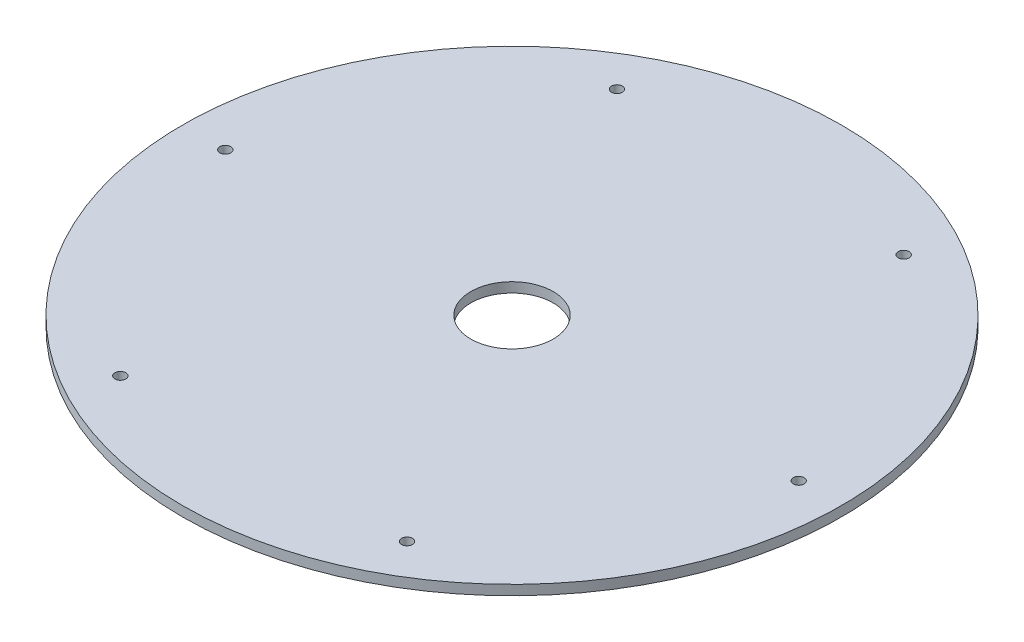
ISO-10303-21;
HEADER;
FILE_DESCRIPTION(('STEP AP214'),'2;1');
FILE_NAME('part.step','',(''),(''),'','','');
FILE_SCHEMA(('AUTOMOTIVE_DESIGN { 1 0 10303 214 1 1 1 1 }'));
ENDSEC;
DATA;
#1=APPLICATION_CONTEXT('core data for automotive mechanical design processes');
#2=APPLICATION_PROTOCOL_DEFINITION('international standard','automotive_design',2000,#1);
#3=PRODUCT_CONTEXT('',#1,'mechanical');
#4=PRODUCT('Part','Part','',(#3));
#5=PRODUCT_RELATED_PRODUCT_CATEGORY('part','',(#4));
#6=PRODUCT_DEFINITION_FORMATION('','',#4);
#7=PRODUCT_DEFINITION_CONTEXT('part definition',#1,'design');
#8=PRODUCT_DEFINITION('design','',#6,#7);
#9=PRODUCT_DEFINITION_SHAPE('','',#8);
#10=(LENGTH_UNIT() NAMED_UNIT(*) SI_UNIT(.MILLI.,.METRE.));
#11=(NAMED_UNIT(*) PLANE_ANGLE_UNIT() SI_UNIT($,.RADIAN.));
#12=(NAMED_UNIT(*) SI_UNIT($,.STERADIAN.) SOLID_ANGLE_UNIT());
#13=UNCERTAINTY_MEASURE_WITH_UNIT(LENGTH_MEASURE(1.E-05),#10,'distance_accuracy_value','');
#14=(GEOMETRIC_REPRESENTATION_CONTEXT(3) GLOBAL_UNCERTAINTY_ASSIGNED_CONTEXT((#13)) GLOBAL_UNIT_ASSIGNED_CONTEXT((#10,
#11,#12)) REPRESENTATION_CONTEXT('',''));
#15=CARTESIAN_POINT('',(0.,0.,0.));
#16=DIRECTION('',(0.,0.,1.));
#17=DIRECTION('',(1.,0.,0.));
#18=AXIS2_PLACEMENT_3D('',#15,#16,#17);
#19=CARTESIAN_POINT('',(0.,3.,0.));
#20=DIRECTION('',(0.,1.,0.));
#21=DIRECTION('',(0.,0.,1.));
#22=AXIS2_PLACEMENT_3D('',#19,#20,#21);
#23=PLANE('',#22);
#24=CARTESIAN_POINT('',(0.,3.,0.));
#25=DIRECTION('',(0.,1.,0.));
#26=DIRECTION('',(0.,0.,1.));
#27=AXIS2_PLACEMENT_3D('',#24,#25,#26);
#28=CIRCLE('',#27,12.5);
#29=CARTESIAN_POINT('',(0.,3.,12.5));
#30=VERTEX_POINT('',#29);
#31=EDGE_CURVE('E79',#30,#30,#28,.T.);
#32=ORIENTED_EDGE('',*,*,#31,.F.);
#33=EDGE_LOOP('',(#32));
#34=FACE_BOUND('',#33,.T.);
#35=CARTESIAN_POINT('',(43.5,3.,75.3442101292461));
#36=DIRECTION('',(0.,1.,0.));
#37=DIRECTION('',(0.,0.,1.));
#38=AXIS2_PLACEMENT_3D('',#35,#36,#37);
#39=CIRCLE('',#38,1.65);
#40=CARTESIAN_POINT('',(43.5,3.,76.9942101292461));
#41=VERTEX_POINT('',#40);
#42=EDGE_CURVE('E64',#41,#41,#39,.T.);
#43=ORIENTED_EDGE('',*,*,#42,.F.);
#44=EDGE_LOOP('',(#43));
#45=FACE_BOUND('',#44,.T.);
#46=CARTESIAN_POINT('',(43.5,3.,-75.3442101292462));
#47=DIRECTION('',(0.,1.,0.));
#48=DIRECTION('',(0.,0.,1.));
#49=AXIS2_PLACEMENT_3D('',#46,#47,#48);
#50=CIRCLE('',#49,1.65);
#51=CARTESIAN_POINT('',(43.5,3.,-73.6942101292462));
#52=VERTEX_POINT('',#51);
#53=EDGE_CURVE('E52',#52,#52,#50,.T.);
#54=ORIENTED_EDGE('',*,*,#53,.F.);
#55=EDGE_LOOP('',(#54));
#56=FACE_BOUND('',#55,.T.);
#57=CARTESIAN_POINT('',(-87.,3.,0.));
#58=DIRECTION('',(0.,1.,0.));
#59=DIRECTION('',(0.,0.,1.));
#60=AXIS2_PLACEMENT_3D('',#57,#58,#59);
#61=CIRCLE('',#60,1.65);
#62=CARTESIAN_POINT('',(-87.,3.,1.65000000000001));
#63=VERTEX_POINT('',#62);
#64=EDGE_CURVE('E41',#63,#63,#61,.T.);
#65=ORIENTED_EDGE('',*,*,#64,.F.);
#66=EDGE_LOOP('',(#65));
#67=FACE_BOUND('',#66,.T.);
#68=CARTESIAN_POINT('',(0.,3.,0.));
#69=DIRECTION('',(0.,1.,0.));
#70=DIRECTION('',(0.,0.,1.));
#71=AXIS2_PLACEMENT_3D('',#68,#69,#70);
#72=CIRCLE('',#71,100.);
#73=CARTESIAN_POINT('',(0.,3.,100.));
#74=VERTEX_POINT('',#73);
#75=EDGE_CURVE('E10',#74,#74,#72,.T.);
#76=ORIENTED_EDGE('',*,*,#75,.T.);
#77=EDGE_LOOP('',(#76));
#78=FACE_BOUND('',#77,.T.);
#79=CARTESIAN_POINT('',(-43.5,3.,-75.3442101292461));
#80=DIRECTION('',(0.,1.,0.));
#81=DIRECTION('',(0.,0.,1.));
#82=AXIS2_PLACEMENT_3D('',#79,#80,#81);
#83=CIRCLE('',#82,1.65);
#84=CARTESIAN_POINT('',(-43.5,3.,-73.6942101292461));
#85=VERTEX_POINT('',#84);
#86=EDGE_CURVE('E46',#85,#85,#83,.T.);
#87=ORIENTED_EDGE('',*,*,#86,.F.);
#88=EDGE_LOOP('',(#87));
#89=FACE_BOUND('',#88,.T.);
#90=CARTESIAN_POINT('',(87.,3.,0.));
#91=DIRECTION('',(0.,1.,0.));
#92=DIRECTION('',(0.,0.,1.));
#93=AXIS2_PLACEMENT_3D('',#90,#91,#92);
#94=CIRCLE('',#93,1.65);
#95=CARTESIAN_POINT('',(87.,3.,1.64999999999998));
#96=VERTEX_POINT('',#95);
#97=EDGE_CURVE('E58',#96,#96,#94,.T.);
#98=ORIENTED_EDGE('',*,*,#97,.F.);
#99=EDGE_LOOP('',(#98));
#100=FACE_BOUND('',#99,.T.);
#101=CARTESIAN_POINT('',(-43.4999999999999,3.,75.3442101292462));
#102=DIRECTION('',(0.,1.,0.));
#103=DIRECTION('',(0.,0.,1.));
#104=AXIS2_PLACEMENT_3D('',#101,#102,#103);
#105=CIRCLE('',#104,1.65);
#106=CARTESIAN_POINT('',(-43.4999999999999,3.,76.9942101292462));
#107=VERTEX_POINT('',#106);
#108=EDGE_CURVE('E70',#107,#107,#105,.T.);
#109=ORIENTED_EDGE('',*,*,#108,.F.);
#110=EDGE_LOOP('',(#109));
#111=FACE_BOUND('',#110,.T.);
#112=ADVANCED_FACE('F30',(#34,#45,#56,#67,#78,#89,#100,#111),#23,.T.);
#113=CARTESIAN_POINT('',(0.,0.,0.));
#114=DIRECTION('',(0.,1.,0.));
#115=DIRECTION('',(0.,0.,1.));
#116=AXIS2_PLACEMENT_3D('',#113,#114,#115);
#117=PLANE('',#116);
#118=CARTESIAN_POINT('',(0.,0.,0.));
#119=DIRECTION('',(0.,1.,0.));
#120=DIRECTION('',(0.,0.,1.));
#121=AXIS2_PLACEMENT_3D('',#118,#119,#120);
#122=CIRCLE('',#121,12.5);
#123=CARTESIAN_POINT('',(0.,0.,12.5));
#124=VERTEX_POINT('',#123);
#125=EDGE_CURVE('E76',#124,#124,#122,.T.);
#126=ORIENTED_EDGE('',*,*,#125,.T.);
#127=EDGE_LOOP('',(#126));
#128=FACE_BOUND('',#127,.T.);
#129=CARTESIAN_POINT('',(0.,0.,0.));
#130=DIRECTION('',(0.,1.,0.));
#131=DIRECTION('',(0.,0.,1.));
#132=AXIS2_PLACEMENT_3D('',#129,#130,#131);
#133=CIRCLE('',#132,100.);
#134=CARTESIAN_POINT('',(0.,0.,100.));
#135=VERTEX_POINT('',#134);
#136=EDGE_CURVE('E34',#135,#135,#133,.T.);
#137=ORIENTED_EDGE('',*,*,#136,.F.);
#138=EDGE_LOOP('',(#137));
#139=FACE_BOUND('',#138,.T.);
#140=CARTESIAN_POINT('',(-87.,0.,0.));
#141=DIRECTION('',(0.,1.,0.));
#142=DIRECTION('',(0.,0.,1.));
#143=AXIS2_PLACEMENT_3D('',#140,#141,#142);
#144=CIRCLE('',#143,1.65);
#145=CARTESIAN_POINT('',(-87.,0.,1.65000000000001));
#146=VERTEX_POINT('',#145);
#147=EDGE_CURVE('E43',#146,#146,#144,.T.);
#148=ORIENTED_EDGE('',*,*,#147,.T.);
#149=EDGE_LOOP('',(#148));
#150=FACE_BOUND('',#149,.T.);
#151=CARTESIAN_POINT('',(-43.5,0.,-75.3442101292461));
#152=DIRECTION('',(0.,1.,0.));
#153=DIRECTION('',(0.,0.,1.));
#154=AXIS2_PLACEMENT_3D('',#151,#152,#153);
#155=CIRCLE('',#154,1.65);
#156=CARTESIAN_POINT('',(-43.5,0.,-73.6942101292461));
#157=VERTEX_POINT('',#156);
#158=EDGE_CURVE('E49',#157,#157,#155,.T.);
#159=ORIENTED_EDGE('',*,*,#158,.T.);
#160=EDGE_LOOP('',(#159));
#161=FACE_BOUND('',#160,.T.);
#162=CARTESIAN_POINT('',(43.5,0.,-75.3442101292462));
#163=DIRECTION('',(0.,1.,0.));
#164=DIRECTION('',(0.,0.,1.));
#165=AXIS2_PLACEMENT_3D('',#162,#163,#164);
#166=CIRCLE('',#165,1.65);
#167=CARTESIAN_POINT('',(43.5,0.,-73.6942101292462));
#168=VERTEX_POINT('',#167);
#169=EDGE_CURVE('E55',#168,#168,#166,.T.);
#170=ORIENTED_EDGE('',*,*,#169,.T.);
#171=EDGE_LOOP('',(#170));
#172=FACE_BOUND('',#171,.T.);
#173=CARTESIAN_POINT('',(87.,0.,0.));
#174=DIRECTION('',(0.,1.,0.));
#175=DIRECTION('',(0.,0.,1.));
#176=AXIS2_PLACEMENT_3D('',#173,#174,#175);
#177=CIRCLE('',#176,1.65);
#178=CARTESIAN_POINT('',(87.,0.,1.64999999999998));
#179=VERTEX_POINT('',#178);
#180=EDGE_CURVE('E61',#179,#179,#177,.T.);
#181=ORIENTED_EDGE('',*,*,#180,.T.);
#182=EDGE_LOOP('',(#181));
#183=FACE_BOUND('',#182,.T.);
#184=CARTESIAN_POINT('',(43.5,0.,75.3442101292461));
#185=DIRECTION('',(0.,1.,0.));
#186=DIRECTION('',(0.,0.,1.));
#187=AXIS2_PLACEMENT_3D('',#184,#185,#186);
#188=CIRCLE('',#187,1.65);
#189=CARTESIAN_POINT('',(43.5,0.,76.9942101292461));
#190=VERTEX_POINT('',#189);
#191=EDGE_CURVE('E67',#190,#190,#188,.T.);
#192=ORIENTED_EDGE('',*,*,#191,.T.);
#193=EDGE_LOOP('',(#192));
#194=FACE_BOUND('',#193,.T.);
#195=CARTESIAN_POINT('',(-43.4999999999999,0.,75.3442101292462));
#196=DIRECTION('',(0.,1.,0.));
#197=DIRECTION('',(0.,0.,1.));
#198=AXIS2_PLACEMENT_3D('',#195,#196,#197);
#199=CIRCLE('',#198,1.65);
#200=CARTESIAN_POINT('',(-43.4999999999999,0.,76.9942101292462));
#201=VERTEX_POINT('',#200);
#202=EDGE_CURVE('E73',#201,#201,#199,.T.);
#203=ORIENTED_EDGE('',*,*,#202,.T.);
#204=EDGE_LOOP('',(#203));
#205=FACE_BOUND('',#204,.T.);
#206=ADVANCED_FACE('F85',(#128,#139,#150,#161,#172,#183,#194,#205),#117,.F.);
#207=CARTESIAN_POINT('',(0.,3.,0.));
#208=DIRECTION('',(0.,-1.,0.));
#209=DIRECTION('',(0.,0.,-1.));
#210=AXIS2_PLACEMENT_3D('',#207,#208,#209);
#211=CYLINDRICAL_SURFACE('',#210,100.);
#212=ORIENTED_EDGE('',*,*,#75,.F.);
#213=EDGE_LOOP('',(#212));
#214=FACE_BOUND('',#213,.T.);
#215=ORIENTED_EDGE('',*,*,#136,.T.);
#216=EDGE_LOOP('',(#215));
#217=FACE_BOUND('',#216,.T.);
#218=ADVANCED_FACE('F32',(#214,#217),#211,.T.);
#219=CARTESIAN_POINT('',(-87.,3.,0.));
#220=DIRECTION('',(0.,-1.,0.));
#221=DIRECTION('',(0.,0.,-1.));
#222=AXIS2_PLACEMENT_3D('',#219,#220,#221);
#223=CYLINDRICAL_SURFACE('',#222,1.65);
#224=ORIENTED_EDGE('',*,*,#64,.T.);
#225=EDGE_LOOP('',(#224));
#226=FACE_BOUND('',#225,.T.);
#227=ORIENTED_EDGE('',*,*,#147,.F.);
#228=EDGE_LOOP('',(#227));
#229=FACE_BOUND('',#228,.T.);
#230=ADVANCED_FACE('F120',(#226,#229),#223,.F.);
#231=CARTESIAN_POINT('',(-43.5,3.,-75.3442101292461));
#232=DIRECTION('',(0.,-1.,0.));
#233=DIRECTION('',(0.,0.,-1.));
#234=AXIS2_PLACEMENT_3D('',#231,#232,#233);
#235=CYLINDRICAL_SURFACE('',#234,1.65);
#236=ORIENTED_EDGE('',*,*,#86,.T.);
#237=EDGE_LOOP('',(#236));
#238=FACE_BOUND('',#237,.T.);
#239=ORIENTED_EDGE('',*,*,#158,.F.);
#240=EDGE_LOOP('',(#239));
#241=FACE_BOUND('',#240,.T.);
#242=ADVANCED_FACE('F125',(#238,#241),#235,.F.);
#243=CARTESIAN_POINT('',(43.5,3.,-75.3442101292462));
#244=DIRECTION('',(0.,-1.,0.));
#245=DIRECTION('',(0.,0.,-1.));
#246=AXIS2_PLACEMENT_3D('',#243,#244,#245);
#247=CYLINDRICAL_SURFACE('',#246,1.65);
#248=ORIENTED_EDGE('',*,*,#53,.T.);
#249=EDGE_LOOP('',(#248));
#250=FACE_BOUND('',#249,.T.);
#251=ORIENTED_EDGE('',*,*,#169,.F.);
#252=EDGE_LOOP('',(#251));
#253=FACE_BOUND('',#252,.T.);
#254=ADVANCED_FACE('F129',(#250,#253),#247,.F.);
#255=CARTESIAN_POINT('',(87.,3.,0.));
#256=DIRECTION('',(0.,-1.,0.));
#257=DIRECTION('',(0.,0.,-1.));
#258=AXIS2_PLACEMENT_3D('',#255,#256,#257);
#259=CYLINDRICAL_SURFACE('',#258,1.65);
#260=ORIENTED_EDGE('',*,*,#97,.T.);
#261=EDGE_LOOP('',(#260));
#262=FACE_BOUND('',#261,.T.);
#263=ORIENTED_EDGE('',*,*,#180,.F.);
#264=EDGE_LOOP('',(#263));
#265=FACE_BOUND('',#264,.T.);
#266=ADVANCED_FACE('F133',(#262,#265),#259,.F.);
#267=CARTESIAN_POINT('',(43.5,3.,75.3442101292461));
#268=DIRECTION('',(0.,-1.,0.));
#269=DIRECTION('',(0.,0.,-1.));
#270=AXIS2_PLACEMENT_3D('',#267,#268,#269);
#271=CYLINDRICAL_SURFACE('',#270,1.65);
#272=ORIENTED_EDGE('',*,*,#42,.T.);
#273=EDGE_LOOP('',(#272));
#274=FACE_BOUND('',#273,.T.);
#275=ORIENTED_EDGE('',*,*,#191,.F.);
#276=EDGE_LOOP('',(#275));
#277=FACE_BOUND('',#276,.T.);
#278=ADVANCED_FACE('F112',(#274,#277),#271,.F.);
#279=CARTESIAN_POINT('',(-43.4999999999999,3.,75.3442101292462));
#280=DIRECTION('',(0.,-1.,0.));
#281=DIRECTION('',(0.,0.,-1.));
#282=AXIS2_PLACEMENT_3D('',#279,#280,#281);
#283=CYLINDRICAL_SURFACE('',#282,1.65);
#284=ORIENTED_EDGE('',*,*,#108,.T.);
#285=EDGE_LOOP('',(#284));
#286=FACE_BOUND('',#285,.T.);
#287=ORIENTED_EDGE('',*,*,#202,.F.);
#288=EDGE_LOOP('',(#287));
#289=FACE_BOUND('',#288,.T.);
#290=ADVANCED_FACE('F91',(#286,#289),#283,.F.);
#291=CARTESIAN_POINT('',(0.,0.,0.));
#292=DIRECTION('',(0.,1.,0.));
#293=DIRECTION('',(0.,0.,1.));
#294=AXIS2_PLACEMENT_3D('',#291,#292,#293);
#295=CYLINDRICAL_SURFACE('',#294,12.5);
#296=ORIENTED_EDGE('',*,*,#125,.F.);
#297=EDGE_LOOP('',(#296));
#298=FACE_BOUND('',#297,.T.);
#299=ORIENTED_EDGE('',*,*,#31,.T.);
#300=EDGE_LOOP('',(#299));
#301=FACE_BOUND('',#300,.T.);
#302=ADVANCED_FACE('F88',(#298,#301),#295,.F.);
#303=CLOSED_SHELL('',(#112,#206,#218,#230,#242,#254,#266,#278,#290,#302));
#304=MANIFOLD_SOLID_BREP('B2',#303);
#305=ADVANCED_BREP_SHAPE_REPRESENTATION('',(#18,#304),#14);
#306=SHAPE_DEFINITION_REPRESENTATION(#9,#305);
ENDSEC;
END-ISO-10303-21;
